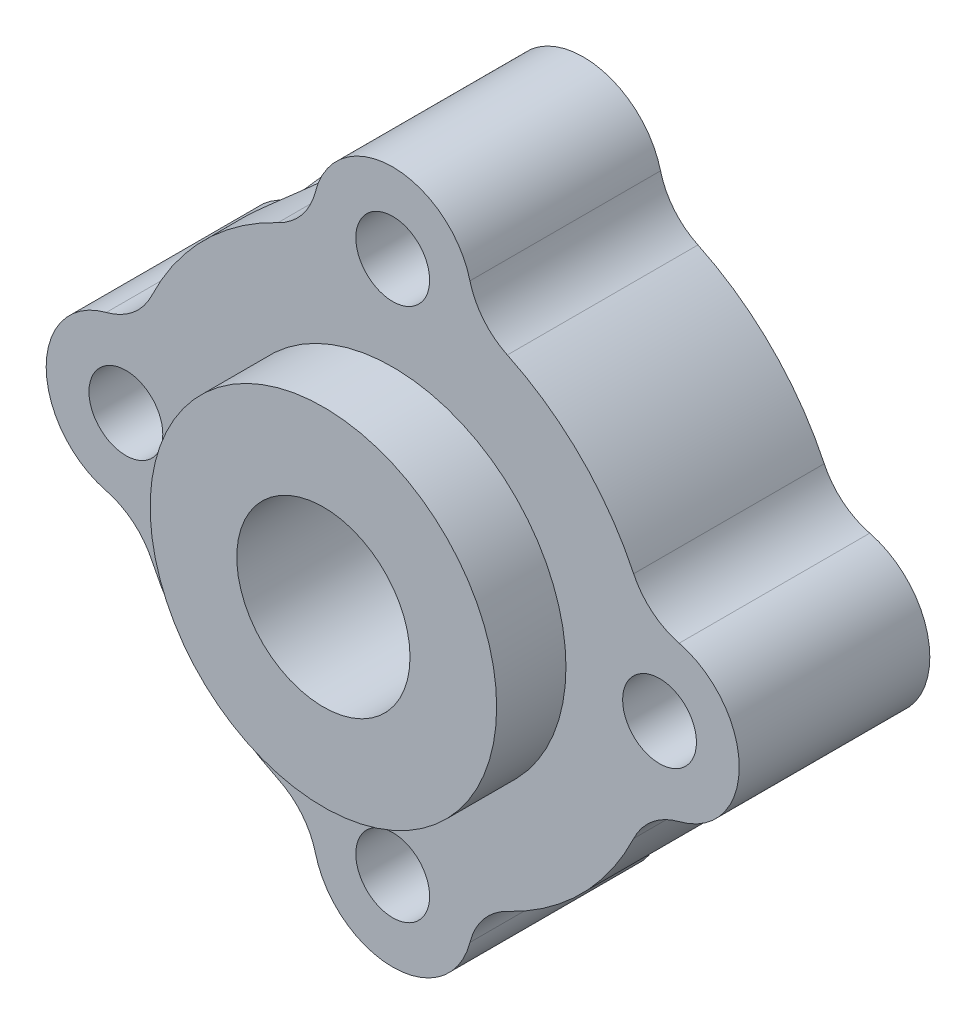
ISO-10303-21;
HEADER;
FILE_DESCRIPTION(('STEP AP214'),'2;1');
FILE_NAME('part.step','',(''),(''),'','','');
FILE_SCHEMA(('AUTOMOTIVE_DESIGN { 1 0 10303 214 1 1 1 1 }'));
ENDSEC;
DATA;
#1=APPLICATION_CONTEXT('core data for automotive mechanical design processes');
#2=APPLICATION_PROTOCOL_DEFINITION('international standard','automotive_design',2000,#1);
#3=PRODUCT_CONTEXT('',#1,'mechanical');
#4=PRODUCT('Part','Part','',(#3));
#5=PRODUCT_RELATED_PRODUCT_CATEGORY('part','',(#4));
#6=PRODUCT_DEFINITION_FORMATION('','',#4);
#7=PRODUCT_DEFINITION_CONTEXT('part definition',#1,'design');
#8=PRODUCT_DEFINITION('design','',#6,#7);
#9=PRODUCT_DEFINITION_SHAPE('','',#8);
#10=(LENGTH_UNIT() NAMED_UNIT(*) SI_UNIT(.MILLI.,.METRE.));
#11=(NAMED_UNIT(*) PLANE_ANGLE_UNIT() SI_UNIT($,.RADIAN.));
#12=(NAMED_UNIT(*) SI_UNIT($,.STERADIAN.) SOLID_ANGLE_UNIT());
#13=UNCERTAINTY_MEASURE_WITH_UNIT(LENGTH_MEASURE(1.E-05),#10,'distance_accuracy_value','');
#14=(GEOMETRIC_REPRESENTATION_CONTEXT(3) GLOBAL_UNCERTAINTY_ASSIGNED_CONTEXT((#13)) GLOBAL_UNIT_ASSIGNED_CONTEXT((#10,
#11,#12)) REPRESENTATION_CONTEXT('',''));
#15=CARTESIAN_POINT('',(0.,0.,0.));
#16=DIRECTION('',(0.,0.,1.));
#17=DIRECTION('',(1.,0.,0.));
#18=AXIS2_PLACEMENT_3D('',#15,#16,#17);
#19=CARTESIAN_POINT('',(-18.9077010991618,16.5563835829711,6.985));
#20=DIRECTION('',(0.,0.,-1.));
#21=DIRECTION('',(-1.,0.,0.));
#22=AXIS2_PLACEMENT_3D('',#19,#20,#21);
#23=CYLINDRICAL_SURFACE('',#22,9.779);
#24=CARTESIAN_POINT('',(-18.9077010991618,16.5563835829711,0.));
#25=DIRECTION('',(0.,0.,1.));
#26=DIRECTION('',(1.,0.,0.));
#27=AXIS2_PLACEMENT_3D('',#24,#25,#26);
#28=CIRCLE('',#27,9.779);
#29=CARTESIAN_POINT('',(-14.7062269233579,7.72595574791956,0.));
#30=VERTEX_POINT('',#29);
#31=CARTESIAN_POINT('',(-10.0772732641102,12.3549094071672,0.));
#32=VERTEX_POINT('',#31);
#33=EDGE_CURVE('E181',#30,#32,#28,.T.);
#34=ORIENTED_EDGE('',*,*,#33,.T.);
#35=DIRECTION('',(0.,0.,-1.));
#36=VECTOR('',#35,1.);
#37=CARTESIAN_POINT('',(-10.0772732641102,12.3549094071672,6.985));
#38=LINE('',#37,#36);
#39=CARTESIAN_POINT('',(-10.0772732641102,12.3549094071672,6.985));
#40=VERTEX_POINT('',#39);
#41=EDGE_CURVE('E158',#32,#40,#38,.F.);
#42=ORIENTED_EDGE('',*,*,#41,.T.);
#43=CARTESIAN_POINT('',(-18.9077010991618,16.5563835829711,6.985));
#44=DIRECTION('',(0.,0.,1.));
#45=DIRECTION('',(1.,0.,0.));
#46=AXIS2_PLACEMENT_3D('',#43,#44,#45);
#47=CIRCLE('',#46,9.779);
#48=CARTESIAN_POINT('',(-14.7062269233579,7.72595574791956,6.985));
#49=VERTEX_POINT('',#48);
#50=EDGE_CURVE('E203',#49,#40,#47,.T.);
#51=ORIENTED_EDGE('',*,*,#50,.F.);
#52=DIRECTION('',(0.,0.,-1.));
#53=VECTOR('',#52,1.);
#54=CARTESIAN_POINT('',(-14.7062269233579,7.72595574791956,6.985));
#55=LINE('',#54,#53);
#56=EDGE_CURVE('E174',#49,#30,#55,.T.);
#57=ORIENTED_EDGE('',*,*,#56,.T.);
#58=EDGE_LOOP('',(#34,#42,#51,#57));
#59=FACE_BOUND('',#58,.T.);
#60=ADVANCED_FACE('F34',(#59),#23,.T.);
#61=CARTESIAN_POINT('',(-9.12870109916178,16.5563835829711,6.985));
#62=DIRECTION('',(0.,0.,-1.));
#63=DIRECTION('',(-1.,0.,0.));
#64=AXIS2_PLACEMENT_3D('',#61,#62,#63);
#65=CYLINDRICAL_SURFACE('',#64,2.921);
#66=CARTESIAN_POINT('',(-9.12870109916178,16.5563835829711,6.985));
#67=DIRECTION('',(0.,0.,1.));
#68=DIRECTION('',(1.,0.,0.));
#69=AXIS2_PLACEMENT_3D('',#66,#67,#68);
#70=CIRCLE('',#69,2.921);
#71=CARTESIAN_POINT('',(-8.40925818161421,13.725369120205,6.985));
#72=VERTEX_POINT('',#71);
#73=CARTESIAN_POINT('',(-8.40925818161421,19.3873980457372,6.985));
#74=VERTEX_POINT('',#73);
#75=EDGE_CURVE('E173',#72,#74,#70,.T.);
#76=ORIENTED_EDGE('',*,*,#75,.F.);
#77=DIRECTION('',(0.,0.,-1.));
#78=VECTOR('',#77,1.);
#79=CARTESIAN_POINT('',(-8.40925818161421,13.725369120205,6.985));
#80=LINE('',#79,#78);
#81=CARTESIAN_POINT('',(-8.40925818161421,13.725369120205,0.));
#82=VERTEX_POINT('',#81);
#83=EDGE_CURVE('E157',#72,#82,#80,.T.);
#84=ORIENTED_EDGE('',*,*,#83,.T.);
#85=CARTESIAN_POINT('',(-9.12870109916178,16.5563835829711,0.));
#86=DIRECTION('',(0.,0.,1.));
#87=DIRECTION('',(1.,0.,0.));
#88=AXIS2_PLACEMENT_3D('',#85,#86,#87);
#89=CIRCLE('',#88,2.921);
#90=CARTESIAN_POINT('',(-8.40925818161421,19.3873980457372,0.));
#91=VERTEX_POINT('',#90);
#92=EDGE_CURVE('E170',#82,#91,#89,.T.);
#93=ORIENTED_EDGE('',*,*,#92,.T.);
#94=DIRECTION('',(0.,0.,-1.));
#95=VECTOR('',#94,1.);
#96=CARTESIAN_POINT('',(-8.40925818161421,19.3873980457372,6.985));
#97=LINE('',#96,#95);
#98=EDGE_CURVE('E175',#91,#74,#97,.F.);
#99=ORIENTED_EDGE('',*,*,#98,.T.);
#100=EDGE_LOOP('',(#76,#84,#93,#99));
#101=FACE_BOUND('',#100,.T.);
#102=ADVANCED_FACE('F169',(#101),#65,.T.);
#103=CARTESIAN_POINT('',(-18.9077010991618,16.5563835829711,6.985));
#104=DIRECTION('',(0.,0.,-1.));
#105=DIRECTION('',(-1.,0.,0.));
#106=AXIS2_PLACEMENT_3D('',#103,#104,#105);
#107=CYLINDRICAL_SURFACE('',#106,9.779);
#108=CARTESIAN_POINT('',(-18.9077010991618,16.5563835829711,6.985));
#109=DIRECTION('',(0.,0.,1.));
#110=DIRECTION('',(1.,0.,0.));
#111=AXIS2_PLACEMENT_3D('',#108,#109,#110);
#112=CIRCLE('',#111,9.779);
#113=CARTESIAN_POINT('',(-10.0772732641102,20.757857758775,6.985));
#114=VERTEX_POINT('',#113);
#115=CARTESIAN_POINT('',(-14.7062269233579,25.3868114180227,6.985));
#116=VERTEX_POINT('',#115);
#117=EDGE_CURVE('E522',#114,#116,#112,.T.);
#118=ORIENTED_EDGE('',*,*,#117,.F.);
#119=DIRECTION('',(0.,0.,-1.));
#120=VECTOR('',#119,1.);
#121=CARTESIAN_POINT('',(-10.0772732641102,20.757857758775,6.985));
#122=LINE('',#121,#120);
#123=CARTESIAN_POINT('',(-10.0772732641102,20.757857758775,0.));
#124=VERTEX_POINT('',#123);
#125=EDGE_CURVE('E226',#114,#124,#122,.T.);
#126=ORIENTED_EDGE('',*,*,#125,.T.);
#127=CARTESIAN_POINT('',(-18.9077010991618,16.5563835829711,0.));
#128=DIRECTION('',(0.,0.,1.));
#129=DIRECTION('',(1.,0.,0.));
#130=AXIS2_PLACEMENT_3D('',#127,#128,#129);
#131=CIRCLE('',#130,9.779);
#132=CARTESIAN_POINT('',(-14.7062269233579,25.3868114180227,0.));
#133=VERTEX_POINT('',#132);
#134=EDGE_CURVE('E180',#124,#133,#131,.T.);
#135=ORIENTED_EDGE('',*,*,#134,.T.);
#136=DIRECTION('',(0.,0.,-1.));
#137=VECTOR('',#136,1.);
#138=CARTESIAN_POINT('',(-14.7062269233579,25.3868114180227,6.985));
#139=LINE('',#138,#137);
#140=EDGE_CURVE('E224',#133,#116,#139,.F.);
#141=ORIENTED_EDGE('',*,*,#140,.T.);
#142=EDGE_LOOP('',(#118,#126,#135,#141));
#143=FACE_BOUND('',#142,.T.);
#144=ADVANCED_FACE('F324',(#143),#107,.T.);
#145=CARTESIAN_POINT('',(-18.9077010991618,26.3353835829711,6.985));
#146=DIRECTION('',(0.,0.,-1.));
#147=DIRECTION('',(-1.,0.,0.));
#148=AXIS2_PLACEMENT_3D('',#145,#146,#147);
#149=CYLINDRICAL_SURFACE('',#148,2.921);
#150=CARTESIAN_POINT('',(-18.9077010991618,26.3353835829711,6.985));
#151=DIRECTION('',(0.,0.,1.));
#152=DIRECTION('',(1.,0.,0.));
#153=AXIS2_PLACEMENT_3D('',#150,#151,#152);
#154=CIRCLE('',#153,2.921);
#155=CARTESIAN_POINT('',(-16.0766866363957,27.0548265005187,6.985));
#156=VERTEX_POINT('',#155);
#157=CARTESIAN_POINT('',(-21.7387155619278,27.0548265005187,6.985));
#158=VERTEX_POINT('',#157);
#159=EDGE_CURVE('E281',#156,#158,#154,.T.);
#160=ORIENTED_EDGE('',*,*,#159,.F.);
#161=DIRECTION('',(0.,0.,-1.));
#162=VECTOR('',#161,1.);
#163=CARTESIAN_POINT('',(-16.0766866363957,27.0548265005187,6.985));
#164=LINE('',#163,#162);
#165=CARTESIAN_POINT('',(-16.0766866363957,27.0548265005187,0.));
#166=VERTEX_POINT('',#165);
#167=EDGE_CURVE('E231',#156,#166,#164,.T.);
#168=ORIENTED_EDGE('',*,*,#167,.T.);
#169=CARTESIAN_POINT('',(-18.9077010991618,26.3353835829711,0.));
#170=DIRECTION('',(0.,0.,1.));
#171=DIRECTION('',(1.,0.,0.));
#172=AXIS2_PLACEMENT_3D('',#169,#170,#171);
#173=CIRCLE('',#172,2.921);
#174=CARTESIAN_POINT('',(-21.7387155619278,27.0548265005187,0.));
#175=VERTEX_POINT('',#174);
#176=EDGE_CURVE('E184',#166,#175,#173,.T.);
#177=ORIENTED_EDGE('',*,*,#176,.T.);
#178=DIRECTION('',(0.,0.,-1.));
#179=VECTOR('',#178,1.);
#180=CARTESIAN_POINT('',(-21.7387155619278,27.0548265005187,6.985));
#181=LINE('',#180,#179);
#182=EDGE_CURVE('E229',#175,#158,#181,.F.);
#183=ORIENTED_EDGE('',*,*,#182,.T.);
#184=EDGE_LOOP('',(#160,#168,#177,#183));
#185=FACE_BOUND('',#184,.T.);
#186=ADVANCED_FACE('F473',(#185),#149,.T.);
#187=CARTESIAN_POINT('',(-18.9077010991618,16.5563835829711,6.985));
#188=DIRECTION('',(0.,0.,-1.));
#189=DIRECTION('',(-1.,0.,0.));
#190=AXIS2_PLACEMENT_3D('',#187,#188,#189);
#191=CYLINDRICAL_SURFACE('',#190,9.779);
#192=CARTESIAN_POINT('',(-27.1894191464049,21.7565746550346,3.45963024018075));
#193=CARTESIAN_POINT('',(-27.1894179582579,21.7565792852701,3.34013326935154));
#194=CARTESIAN_POINT('',(-27.1839902900434,21.7652514572821,3.22058759832726));
#195=CARTESIAN_POINT('',(-27.1623146896423,21.7995306919697,2.98490332557513));
#196=CARTESIAN_POINT('',(-27.1460590063942,21.8251498858091,2.86876722675742));
#197=CARTESIAN_POINT('',(-27.1028783978451,21.8920637373469,2.64335074011366));
#198=CARTESIAN_POINT('',(-27.0759660159222,21.9333399636725,2.53406246665058));
#199=CARTESIAN_POINT('',(-27.0116855063629,22.0297389923081,2.32511204963179));
#200=CARTESIAN_POINT('',(-26.974317481734,22.0848616582048,2.22544981125498));
#201=CARTESIAN_POINT('',(-26.8887206787447,22.2077420483769,2.03671796627577));
#202=CARTESIAN_POINT('',(-26.8403202290966,22.2756962114304,1.94785409250368));
#203=CARTESIAN_POINT('',(-26.7335200510201,22.4209819186238,1.78503911235989));
#204=CARTESIAN_POINT('',(-26.6751194171561,22.4983143117012,1.71108935766226));
#205=CARTESIAN_POINT('',(-26.5482772720971,22.6605755102986,1.57929493911525));
#206=CARTESIAN_POINT('',(-26.4797170400498,22.7455887259223,1.52166804364349));
#207=CARTESIAN_POINT('',(-26.3343411770413,22.9192970515416,1.42554624089716));
#208=CARTESIAN_POINT('',(-26.2575264536517,23.007991756105,1.38704923292647));
#209=CARTESIAN_POINT('',(-26.0986186736739,23.1846134335266,1.33088513905905));
#210=CARTESIAN_POINT('',(-26.016626489058,23.2725308408621,1.31290289367159));
#211=CARTESIAN_POINT('',(-25.8484822992051,23.4461581512076,1.29731612412961));
#212=CARTESIAN_POINT('',(-25.7623308213547,23.5318683319854,1.29970902317722));
#213=CARTESIAN_POINT('',(-25.5900989670128,23.6969978987085,1.32456876460617));
#214=CARTESIAN_POINT('',(-25.5040479639141,23.7765055095324,1.34665571543923));
#215=CARTESIAN_POINT('',(-25.3331201856351,23.9290330009421,1.40969245282271));
#216=CARTESIAN_POINT('',(-25.2482434517422,24.0020526538974,1.45064290088933));
#217=CARTESIAN_POINT('',(-25.0819983825358,24.1404900716595,1.55045650621094));
#218=CARTESIAN_POINT('',(-25.0006517687899,24.2058640862908,1.60941638543776));
#219=CARTESIAN_POINT('',(-24.8447450507238,24.3274929977231,1.74350431775647));
#220=CARTESIAN_POINT('',(-24.7701858429075,24.3837466906448,1.81863450228118));
#221=CARTESIAN_POINT('',(-24.6290876969876,24.4874878006894,1.98474926773461));
#222=CARTESIAN_POINT('',(-24.5627443497515,24.5347720266519,2.07602710789872));
#223=CARTESIAN_POINT('',(-24.4425163676798,24.6186444506551,2.27088371404546));
#224=CARTESIAN_POINT('',(-24.3886321564042,24.6552322850733,2.37446289804248));
#225=CARTESIAN_POINT('',(-24.2954097225044,24.71754827827,2.59158970480777));
#226=CARTESIAN_POINT('',(-24.2561349200544,24.7432291561739,2.70517820174218));
#227=CARTESIAN_POINT('',(-24.1942858448331,24.7833049181198,2.9387128368082));
#228=CARTESIAN_POINT('',(-24.1717091356415,24.7977014486804,3.05865804469343));
#229=CARTESIAN_POINT('',(-24.1446160072168,24.814943937863,3.29910604197158));
#230=CARTESIAN_POINT('',(-24.1397706731189,24.8180002708469,3.41955672944035));
#231=CARTESIAN_POINT('',(-24.1474621553233,24.8131241774038,3.65967184419436));
#232=CARTESIAN_POINT('',(-24.1599978445587,24.8051924634933,3.77933632195558));
#233=CARTESIAN_POINT('',(-24.2016023676333,24.7785513516028,4.01309601465118));
#234=CARTESIAN_POINT('',(-24.2304835361223,24.759964259154,4.12723875259913));
#235=CARTESIAN_POINT('',(-24.3033283899119,24.7122361770632,4.3482722819261));
#236=CARTESIAN_POINT('',(-24.3472934696036,24.6830942116908,4.45516240176208));
#237=CARTESIAN_POINT('',(-24.4491800529437,24.6139689520034,4.66035663926827));
#238=CARTESIAN_POINT('',(-24.507293898885,24.5738352020665,4.75851450648498));
#239=CARTESIAN_POINT('',(-24.634795939323,24.4832573215093,4.94190843873342));
#240=CARTESIAN_POINT('',(-24.704185429412,24.432812005899,5.02714301667722));
#241=CARTESIAN_POINT('',(-24.8528843754034,24.3212021591536,5.18374527989556));
#242=CARTESIAN_POINT('',(-24.9323420160733,24.2598704576175,5.25485348388891));
#243=CARTESIAN_POINT('',(-25.0972815387606,24.1279797084335,5.37931846011128));
#244=CARTESIAN_POINT('',(-25.1827630826182,24.0574211785563,5.43267622782472));
#245=CARTESIAN_POINT('',(-25.3560515916076,23.9089697838674,5.51968205812179));
#246=CARTESIAN_POINT('',(-25.4438361690753,23.8311362178884,5.55347566820214));
#247=CARTESIAN_POINT('',(-25.6193654022034,23.6695138979195,5.60088745961024));
#248=CARTESIAN_POINT('',(-25.7071100617652,23.5857259921483,5.61450850858393));
#249=CARTESIAN_POINT('',(-25.8780227303135,23.4162416258931,5.62107805990009));
#250=CARTESIAN_POINT('',(-25.9612473999892,23.3306179875949,5.61443889591726));
#251=CARTESIAN_POINT('',(-26.1226887416933,23.1584081137783,5.58162264813069));
#252=CARTESIAN_POINT('',(-26.2009054526188,23.0718218857425,5.55544571609768));
#253=CARTESIAN_POINT('',(-26.3503728324755,22.900545582989,5.48444783142012));
#254=CARTESIAN_POINT('',(-26.4216329040343,22.8158530715919,5.43965248672234));
#255=CARTESIAN_POINT('',(-26.5559474747405,22.6510112621242,5.33275143273512));
#256=CARTESIAN_POINT('',(-26.6190010888102,22.5708624546237,5.27064385856345));
#257=CARTESIAN_POINT('',(-26.7371593272018,22.4162553221702,5.12937873362491));
#258=CARTESIAN_POINT('',(-26.7920735801415,22.3419481178005,5.04989649515024));
#259=CARTESIAN_POINT('',(-26.8917180342888,22.203648153286,4.87678933328057));
#260=CARTESIAN_POINT('',(-26.9364457611832,22.1396579002347,4.78316098295388));
#261=CARTESIAN_POINT('',(-27.0157980578267,22.0237973763313,4.58291991367117));
#262=CARTESIAN_POINT('',(-27.0502817571493,21.9720978906096,4.47615238008993));
#263=CARTESIAN_POINT('',(-27.1080248462726,21.8842645565145,4.25362673922062));
#264=CARTESIAN_POINT('',(-27.1312938840338,21.8481173314321,4.13787645968437));
#265=CARTESIAN_POINT('',(-27.1623665537818,21.7994699481012,3.92828028601224));
#266=CARTESIAN_POINT('',(-27.1725053283367,21.7834298459832,3.8355800021959));
#267=CARTESIAN_POINT('',(-27.1860319087779,21.7619806617362,3.64847330158703));
#268=CARTESIAN_POINT('',(-27.1894200853803,21.7565709958259,3.55406697877074));
#269=CARTESIAN_POINT('',(-27.1894191464049,21.7565746550346,3.45963024018075));
#270=B_SPLINE_CURVE_WITH_KNOTS('',3,(#192,#193,#194,#195,#196,#197,#198,#199,#200,#201,#202,
#203,#204,#205,#206,#207,#208,#209,#210,#211,#212,#213,#214,#215,#216,#217,#218,#219,#220,#221,
#222,#223,#224,#225,#226,#227,#228,#229,#230,#231,#232,#233,#234,#235,#236,#237,#238,#239,#240,
#241,#242,#243,#244,#245,#246,#247,#248,#249,#250,#251,#252,#253,#254,#255,#256,#257,#258,#259,
#260,#261,#262,#263,#264,#265,#266,#267,#268,#269),.UNSPECIFIED.,.T.,.F.,(4,2,2,2,2,2,2,2,2,2,2,
2,2,2,2,2,2,2,2,2,2,2,2,2,2,2,2,2,2,2,2,2,2,2,2,2,2,2,4),(0.,0.358144200533346,
0.716545048774927,1.07452529230911,1.43250200920476,1.7964836934683,2.1604983507646,
2.52916242940528,2.89778601526011,3.26066693519596,3.62350196309416,3.9794859002267,
4.33548232216343,4.69342532553154,5.05141553884375,5.41673943937334,5.78207575760016,
6.14898000621047,6.51583070921847,6.875840857973,7.23582766307398,7.59176288413942,
7.94773101753385,8.30883873728756,8.66998797836246,9.03725760724951,9.40450663535534,
9.76898719255694,10.1334159317696,10.4904776655113,10.8475366256019,11.2041060999958,
11.5607139990897,11.9246634478824,12.2887012061451,12.6575350800504,13.0260510776773,
13.3091028364861,13.5921390507817),.UNSPECIFIED.);
#271=CARTESIAN_POINT('',(-27.1894191464049,21.7565746550346,3.45963024018075));
#272=VERTEX_POINT('',#271);
#273=EDGE_CURVE('E504',#272,#272,#270,.T.);
#274=ORIENTED_EDGE('',*,*,#273,.T.);
#275=EDGE_LOOP('',(#274));
#276=FACE_BOUND('',#275,.T.);
#277=CARTESIAN_POINT('',(-18.9077010991618,16.5563835829711,6.985));
#278=DIRECTION('',(0.,0.,1.));
#279=DIRECTION('',(1.,0.,0.));
#280=AXIS2_PLACEMENT_3D('',#277,#278,#279);
#281=CIRCLE('',#280,9.779);
#282=CARTESIAN_POINT('',(-23.1091752749657,25.3868114180227,6.985));
#283=VERTEX_POINT('',#282);
#284=CARTESIAN_POINT('',(-27.7381289342133,20.757857758775,6.985));
#285=VERTEX_POINT('',#284);
#286=EDGE_CURVE('E273',#283,#285,#281,.T.);
#287=ORIENTED_EDGE('',*,*,#286,.F.);
#288=DIRECTION('',(0.,0.,-1.));
#289=VECTOR('',#288,1.);
#290=CARTESIAN_POINT('',(-23.1091752749657,25.3868114180227,6.985));
#291=LINE('',#290,#289);
#292=CARTESIAN_POINT('',(-23.1091752749657,25.3868114180227,0.));
#293=VERTEX_POINT('',#292);
#294=EDGE_CURVE('E164',#283,#293,#291,.T.);
#295=ORIENTED_EDGE('',*,*,#294,.T.);
#296=CARTESIAN_POINT('',(-18.9077010991618,16.5563835829711,0.));
#297=DIRECTION('',(0.,0.,1.));
#298=DIRECTION('',(1.,0.,0.));
#299=AXIS2_PLACEMENT_3D('',#296,#297,#298);
#300=CIRCLE('',#299,9.779);
#301=CARTESIAN_POINT('',(-27.7381289342133,20.757857758775,0.));
#302=VERTEX_POINT('',#301);
#303=EDGE_CURVE('E192',#293,#302,#300,.T.);
#304=ORIENTED_EDGE('',*,*,#303,.T.);
#305=DIRECTION('',(0.,0.,-1.));
#306=VECTOR('',#305,1.);
#307=CARTESIAN_POINT('',(-27.7381289342133,20.757857758775,6.985));
#308=LINE('',#307,#306);
#309=EDGE_CURVE('E54',#302,#285,#308,.F.);
#310=ORIENTED_EDGE('',*,*,#309,.T.);
#311=EDGE_LOOP('',(#287,#295,#304,#310));
#312=FACE_BOUND('',#311,.T.);
#313=ADVANCED_FACE('F264',(#276,#312),#191,.T.);
#314=CARTESIAN_POINT('',(-28.6867010991618,16.5563835829711,6.985));
#315=DIRECTION('',(0.,0.,-1.));
#316=DIRECTION('',(-1.,0.,0.));
#317=AXIS2_PLACEMENT_3D('',#314,#315,#316);
#318=CYLINDRICAL_SURFACE('',#317,2.921);
#319=CARTESIAN_POINT('',(-28.6867010991618,16.5563835829711,0.));
#320=DIRECTION('',(0.,0.,1.));
#321=DIRECTION('',(1.,0.,0.));
#322=AXIS2_PLACEMENT_3D('',#319,#320,#321);
#323=CIRCLE('',#322,2.921);
#324=CARTESIAN_POINT('',(-29.4061440167093,19.3873980457372,0.));
#325=VERTEX_POINT('',#324);
#326=CARTESIAN_POINT('',(-29.4061440167093,13.725369120205,0.));
#327=VERTEX_POINT('',#326);
#328=EDGE_CURVE('E194',#325,#327,#323,.T.);
#329=ORIENTED_EDGE('',*,*,#328,.T.);
#330=DIRECTION('',(0.,0.,-1.));
#331=VECTOR('',#330,1.);
#332=CARTESIAN_POINT('',(-29.4061440167093,13.725369120205,6.985));
#333=LINE('',#332,#331);
#334=CARTESIAN_POINT('',(-29.4061440167093,13.725369120205,6.985));
#335=VERTEX_POINT('',#334);
#336=EDGE_CURVE('E222',#327,#335,#333,.F.);
#337=ORIENTED_EDGE('',*,*,#336,.T.);
#338=CARTESIAN_POINT('',(-28.6867010991618,16.5563835829711,6.985));
#339=DIRECTION('',(0.,0.,1.));
#340=DIRECTION('',(1.,0.,0.));
#341=AXIS2_PLACEMENT_3D('',#338,#339,#340);
#342=CIRCLE('',#341,2.921);
#343=CARTESIAN_POINT('',(-29.4061440167093,19.3873980457372,6.985));
#344=VERTEX_POINT('',#343);
#345=EDGE_CURVE('E271',#344,#335,#342,.T.);
#346=ORIENTED_EDGE('',*,*,#345,.F.);
#347=DIRECTION('',(0.,0.,-1.));
#348=VECTOR('',#347,1.);
#349=CARTESIAN_POINT('',(-29.4061440167093,19.3873980457372,6.985));
#350=LINE('',#349,#348);
#351=EDGE_CURVE('E219',#344,#325,#350,.T.);
#352=ORIENTED_EDGE('',*,*,#351,.T.);
#353=EDGE_LOOP('',(#329,#337,#346,#352));
#354=FACE_BOUND('',#353,.T.);
#355=ADVANCED_FACE('F275',(#354),#318,.T.);
#356=CARTESIAN_POINT('',(-18.9077010991618,16.5563835829711,6.985));
#357=DIRECTION('',(0.,0.,-1.));
#358=DIRECTION('',(-1.,0.,0.));
#359=AXIS2_PLACEMENT_3D('',#356,#357,#358);
#360=CYLINDRICAL_SURFACE('',#359,9.779);
#361=CARTESIAN_POINT('',(-18.9077010991618,16.5563835829711,0.));
#362=DIRECTION('',(0.,0.,1.));
#363=DIRECTION('',(1.,0.,0.));
#364=AXIS2_PLACEMENT_3D('',#361,#362,#363);
#365=CIRCLE('',#364,9.779);
#366=CARTESIAN_POINT('',(-27.7381289342133,12.3549094071672,0.));
#367=VERTEX_POINT('',#366);
#368=CARTESIAN_POINT('',(-23.1091752749657,7.72595574791956,0.));
#369=VERTEX_POINT('',#368);
#370=EDGE_CURVE('E197',#367,#369,#365,.T.);
#371=ORIENTED_EDGE('',*,*,#370,.T.);
#372=DIRECTION('',(0.,0.,-1.));
#373=VECTOR('',#372,1.);
#374=CARTESIAN_POINT('',(-23.1091752749657,7.72595574791956,6.985));
#375=LINE('',#374,#373);
#376=CARTESIAN_POINT('',(-23.1091752749657,7.72595574791956,6.985));
#377=VERTEX_POINT('',#376);
#378=EDGE_CURVE('E217',#369,#377,#375,.F.);
#379=ORIENTED_EDGE('',*,*,#378,.T.);
#380=CARTESIAN_POINT('',(-18.9077010991618,16.5563835829711,6.985));
#381=DIRECTION('',(0.,0.,1.));
#382=DIRECTION('',(1.,0.,0.));
#383=AXIS2_PLACEMENT_3D('',#380,#381,#382);
#384=CIRCLE('',#383,9.779);
#385=CARTESIAN_POINT('',(-27.7381289342133,12.3549094071672,6.985));
#386=VERTEX_POINT('',#385);
#387=EDGE_CURVE('E277',#386,#377,#384,.T.);
#388=ORIENTED_EDGE('',*,*,#387,.F.);
#389=DIRECTION('',(0.,0.,-1.));
#390=VECTOR('',#389,1.);
#391=CARTESIAN_POINT('',(-27.7381289342133,12.3549094071672,6.985));
#392=LINE('',#391,#390);
#393=EDGE_CURVE('E214',#386,#367,#392,.T.);
#394=ORIENTED_EDGE('',*,*,#393,.T.);
#395=EDGE_LOOP('',(#371,#379,#388,#394));
#396=FACE_BOUND('',#395,.T.);
#397=ADVANCED_FACE('F303',(#396),#360,.T.);
#398=CARTESIAN_POINT('',(-18.9077010991618,6.77738358297111,6.985));
#399=DIRECTION('',(0.,0.,-1.));
#400=DIRECTION('',(-1.,0.,0.));
#401=AXIS2_PLACEMENT_3D('',#398,#399,#400);
#402=CYLINDRICAL_SURFACE('',#401,2.921);
#403=CARTESIAN_POINT('',(-18.9077010991618,6.77738358297111,0.));
#404=DIRECTION('',(0.,0.,1.));
#405=DIRECTION('',(1.,0.,0.));
#406=AXIS2_PLACEMENT_3D('',#403,#404,#405);
#407=CIRCLE('',#406,2.921);
#408=CARTESIAN_POINT('',(-21.7387155619278,6.05794066542354,0.));
#409=VERTEX_POINT('',#408);
#410=CARTESIAN_POINT('',(-16.0766866363957,6.05794066542354,0.));
#411=VERTEX_POINT('',#410);
#412=EDGE_CURVE('E200',#409,#411,#407,.T.);
#413=ORIENTED_EDGE('',*,*,#412,.T.);
#414=DIRECTION('',(0.,0.,-1.));
#415=VECTOR('',#414,1.);
#416=CARTESIAN_POINT('',(-16.0766866363957,6.05794066542354,6.985));
#417=LINE('',#416,#415);
#418=CARTESIAN_POINT('',(-16.0766866363957,6.05794066542354,6.985));
#419=VERTEX_POINT('',#418);
#420=EDGE_CURVE('E212',#411,#419,#417,.F.);
#421=ORIENTED_EDGE('',*,*,#420,.T.);
#422=CARTESIAN_POINT('',(-18.9077010991618,6.77738358297111,6.985));
#423=DIRECTION('',(0.,0.,1.));
#424=DIRECTION('',(1.,0.,0.));
#425=AXIS2_PLACEMENT_3D('',#422,#423,#424);
#426=CIRCLE('',#425,2.921);
#427=CARTESIAN_POINT('',(-21.7387155619278,6.05794066542354,6.985));
#428=VERTEX_POINT('',#427);
#429=EDGE_CURVE('E204',#428,#419,#426,.T.);
#430=ORIENTED_EDGE('',*,*,#429,.F.);
#431=DIRECTION('',(0.,0.,-1.));
#432=VECTOR('',#431,1.);
#433=CARTESIAN_POINT('',(-21.7387155619278,6.05794066542354,6.985));
#434=LINE('',#433,#432);
#435=EDGE_CURVE('E209',#428,#409,#434,.T.);
#436=ORIENTED_EDGE('',*,*,#435,.T.);
#437=EDGE_LOOP('',(#413,#421,#430,#436));
#438=FACE_BOUND('',#437,.T.);
#439=ADVANCED_FACE('F297',(#438),#402,.T.);
#440=CARTESIAN_POINT('',(-14.0182010991618,16.5563835829711,6.985));
#441=DIRECTION('',(0.,0.,1.));
#442=DIRECTION('',(1.,0.,0.));
#443=AXIS2_PLACEMENT_3D('',#440,#441,#442);
#444=PLANE('',#443);
#445=CARTESIAN_POINT('',(-18.9077010991618,26.3353835829711,6.985));
#446=DIRECTION('',(0.,0.,1.));
#447=DIRECTION('',(1.,0.,0.));
#448=AXIS2_PLACEMENT_3D('',#445,#446,#447);
#449=CIRCLE('',#448,1.35254999999999);
#450=CARTESIAN_POINT('',(-17.5551510991618,26.3353835829711,6.985));
#451=VERTEX_POINT('',#450);
#452=EDGE_CURVE('E563',#451,#451,#449,.T.);
#453=ORIENTED_EDGE('',*,*,#452,.F.);
#454=EDGE_LOOP('',(#453));
#455=FACE_BOUND('',#454,.T.);
#456=CARTESIAN_POINT('',(-28.6867010991618,16.5563835829711,6.985));
#457=DIRECTION('',(0.,0.,1.));
#458=DIRECTION('',(1.,0.,0.));
#459=AXIS2_PLACEMENT_3D('',#456,#457,#458);
#460=CIRCLE('',#459,1.35254999999999);
#461=CARTESIAN_POINT('',(-27.3341510991618,16.5563835829711,6.985));
#462=VERTEX_POINT('',#461);
#463=EDGE_CURVE('E558',#462,#462,#460,.T.);
#464=ORIENTED_EDGE('',*,*,#463,.F.);
#465=EDGE_LOOP('',(#464));
#466=FACE_BOUND('',#465,.T.);
#467=CARTESIAN_POINT('',(-18.9077010991618,6.7773835829711,6.985));
#468=DIRECTION('',(0.,0.,1.));
#469=DIRECTION('',(1.,0.,0.));
#470=AXIS2_PLACEMENT_3D('',#467,#468,#469);
#471=CIRCLE('',#470,1.35254999999999);
#472=CARTESIAN_POINT('',(-17.5551510991618,6.7773835829711,6.985));
#473=VERTEX_POINT('',#472);
#474=EDGE_CURVE('E552',#473,#473,#471,.T.);
#475=ORIENTED_EDGE('',*,*,#474,.F.);
#476=EDGE_LOOP('',(#475));
#477=FACE_BOUND('',#476,.T.);
#478=CARTESIAN_POINT('',(-9.12870109916177,16.5563835829711,6.985));
#479=DIRECTION('',(0.,0.,1.));
#480=DIRECTION('',(1.,0.,0.));
#481=AXIS2_PLACEMENT_3D('',#478,#479,#480);
#482=CIRCLE('',#481,1.35254999999999);
#483=CARTESIAN_POINT('',(-7.77615109916178,16.5563835829711,6.985));
#484=VERTEX_POINT('',#483);
#485=EDGE_CURVE('E544',#484,#484,#482,.T.);
#486=ORIENTED_EDGE('',*,*,#485,.F.);
#487=EDGE_LOOP('',(#486));
#488=FACE_BOUND('',#487,.T.);
#489=CARTESIAN_POINT('',(-18.9077010991618,16.5563835829711,6.985));
#490=DIRECTION('',(0.,0.,1.));
#491=DIRECTION('',(1.,0.,0.));
#492=AXIS2_PLACEMENT_3D('',#489,#490,#491);
#493=CIRCLE('',#492,6.35);
#494=CARTESIAN_POINT('',(-12.5577010991618,16.5563835829711,6.985));
#495=VERTEX_POINT('',#494);
#496=EDGE_CURVE('E535',#495,#495,#493,.T.);
#497=ORIENTED_EDGE('',*,*,#496,.F.);
#498=EDGE_LOOP('',(#497));
#499=FACE_BOUND('',#498,.T.);
#500=ORIENTED_EDGE('',*,*,#429,.T.);
#501=CARTESIAN_POINT('',(-13.6149349296426,5.43233812842565,6.985));
#502=DIRECTION('',(0.,0.,1.));
#503=DIRECTION('',(1.,0.,0.));
#504=AXIS2_PLACEMENT_3D('',#501,#502,#503);
#505=CIRCLE('',#504,2.54);
#506=EDGE_CURVE('E240',#419,#49,#505,.F.);
#507=ORIENTED_EDGE('',*,*,#506,.T.);
#508=ORIENTED_EDGE('',*,*,#50,.T.);
#509=CARTESIAN_POINT('',(-7.78365564461632,11.2636174134519,6.985));
#510=DIRECTION('',(0.,0.,1.));
#511=DIRECTION('',(1.,0.,0.));
#512=AXIS2_PLACEMENT_3D('',#509,#510,#511);
#513=CIRCLE('',#512,2.54);
#514=EDGE_CURVE('E163',#40,#72,#513,.F.);
#515=ORIENTED_EDGE('',*,*,#514,.T.);
#516=ORIENTED_EDGE('',*,*,#75,.T.);
#517=CARTESIAN_POINT('',(-7.78365564461632,21.8491497524903,6.985));
#518=DIRECTION('',(0.,0.,1.));
#519=DIRECTION('',(1.,0.,0.));
#520=AXIS2_PLACEMENT_3D('',#517,#518,#519);
#521=CIRCLE('',#520,2.54);
#522=EDGE_CURVE('E251',#74,#114,#521,.F.);
#523=ORIENTED_EDGE('',*,*,#522,.T.);
#524=ORIENTED_EDGE('',*,*,#117,.T.);
#525=CARTESIAN_POINT('',(-13.6149349296426,27.6804290375166,6.985));
#526=DIRECTION('',(0.,0.,1.));
#527=DIRECTION('',(1.,0.,0.));
#528=AXIS2_PLACEMENT_3D('',#525,#526,#527);
#529=CIRCLE('',#528,2.54);
#530=EDGE_CURVE('E255',#116,#156,#529,.F.);
#531=ORIENTED_EDGE('',*,*,#530,.T.);
#532=ORIENTED_EDGE('',*,*,#159,.T.);
#533=CARTESIAN_POINT('',(-24.2004672686809,27.6804290375166,6.985));
#534=DIRECTION('',(0.,0.,1.));
#535=DIRECTION('',(1.,0.,0.));
#536=AXIS2_PLACEMENT_3D('',#533,#534,#535);
#537=CIRCLE('',#536,2.54);
#538=EDGE_CURVE('E61',#158,#283,#537,.F.);
#539=ORIENTED_EDGE('',*,*,#538,.T.);
#540=ORIENTED_EDGE('',*,*,#286,.T.);
#541=CARTESIAN_POINT('',(-30.0317465537072,21.8491497524903,6.985));
#542=DIRECTION('',(0.,0.,1.));
#543=DIRECTION('',(1.,0.,0.));
#544=AXIS2_PLACEMENT_3D('',#541,#542,#543);
#545=CIRCLE('',#544,2.54);
#546=EDGE_CURVE('E11',#285,#344,#545,.F.);
#547=ORIENTED_EDGE('',*,*,#546,.T.);
#548=ORIENTED_EDGE('',*,*,#345,.T.);
#549=CARTESIAN_POINT('',(-30.0317465537072,11.2636174134519,6.985));
#550=DIRECTION('',(0.,0.,1.));
#551=DIRECTION('',(1.,0.,0.));
#552=AXIS2_PLACEMENT_3D('',#549,#550,#551);
#553=CIRCLE('',#552,2.54);
#554=EDGE_CURVE('E248',#335,#386,#553,.F.);
#555=ORIENTED_EDGE('',*,*,#554,.T.);
#556=ORIENTED_EDGE('',*,*,#387,.T.);
#557=CARTESIAN_POINT('',(-24.2004672686809,5.43233812842565,6.985));
#558=DIRECTION('',(0.,0.,1.));
#559=DIRECTION('',(1.,0.,0.));
#560=AXIS2_PLACEMENT_3D('',#557,#558,#559);
#561=CIRCLE('',#560,2.54);
#562=EDGE_CURVE('E244',#377,#428,#561,.F.);
#563=ORIENTED_EDGE('',*,*,#562,.T.);
#564=EDGE_LOOP('',(#500,#507,#508,#515,#516,#523,#524,#531,#532,#539,#540,#547,#548,#555,#556,#563));
#565=FACE_BOUND('',#564,.T.);
#566=ADVANCED_FACE('F270',(#455,#466,#477,#488,#499,#565),#444,.T.);
#567=CARTESIAN_POINT('',(-14.0182010991618,16.5563835829711,0.));
#568=DIRECTION('',(0.,0.,1.));
#569=DIRECTION('',(1.,0.,0.));
#570=AXIS2_PLACEMENT_3D('',#567,#568,#569);
#571=PLANE('',#570);
#572=CARTESIAN_POINT('',(-18.9077010991618,26.3353835829711,0.));
#573=DIRECTION('',(0.,0.,-1.));
#574=DIRECTION('',(-1.,0.,0.));
#575=AXIS2_PLACEMENT_3D('',#572,#573,#574);
#576=CIRCLE('',#575,1.35254999999999);
#577=CARTESIAN_POINT('',(-20.2602510991618,26.3353835829711,0.));
#578=VERTEX_POINT('',#577);
#579=EDGE_CURVE('E509',#578,#578,#576,.T.);
#580=ORIENTED_EDGE('',*,*,#579,.F.);
#581=EDGE_LOOP('',(#580));
#582=FACE_BOUND('',#581,.T.);
#583=CARTESIAN_POINT('',(-28.6867010991618,16.5563835829711,0.));
#584=DIRECTION('',(0.,0.,-1.));
#585=DIRECTION('',(-1.,0.,0.));
#586=AXIS2_PLACEMENT_3D('',#583,#584,#585);
#587=CIRCLE('',#586,1.35254999999999);
#588=CARTESIAN_POINT('',(-30.0392510991618,16.5563835829711,0.));
#589=VERTEX_POINT('',#588);
#590=EDGE_CURVE('E561',#589,#589,#587,.T.);
#591=ORIENTED_EDGE('',*,*,#590,.F.);
#592=EDGE_LOOP('',(#591));
#593=FACE_BOUND('',#592,.T.);
#594=CARTESIAN_POINT('',(-18.9077010991618,6.7773835829711,0.));
#595=DIRECTION('',(0.,0.,-1.));
#596=DIRECTION('',(-1.,0.,0.));
#597=AXIS2_PLACEMENT_3D('',#594,#595,#596);
#598=CIRCLE('',#597,1.35254999999999);
#599=CARTESIAN_POINT('',(-20.2602510991618,6.7773835829711,0.));
#600=VERTEX_POINT('',#599);
#601=EDGE_CURVE('E555',#600,#600,#598,.T.);
#602=ORIENTED_EDGE('',*,*,#601,.F.);
#603=EDGE_LOOP('',(#602));
#604=FACE_BOUND('',#603,.T.);
#605=CARTESIAN_POINT('',(-9.12870109916177,16.5563835829711,0.));
#606=DIRECTION('',(0.,0.,-1.));
#607=DIRECTION('',(-1.,0.,0.));
#608=AXIS2_PLACEMENT_3D('',#605,#606,#607);
#609=CIRCLE('',#608,1.35254999999999);
#610=CARTESIAN_POINT('',(-10.4812510991618,16.5563835829711,0.));
#611=VERTEX_POINT('',#610);
#612=EDGE_CURVE('E549',#611,#611,#609,.T.);
#613=ORIENTED_EDGE('',*,*,#612,.F.);
#614=EDGE_LOOP('',(#613));
#615=FACE_BOUND('',#614,.T.);
#616=CARTESIAN_POINT('',(-18.9077010991618,16.5563835829711,0.));
#617=DIRECTION('',(0.,0.,1.));
#618=DIRECTION('',(1.,0.,0.));
#619=AXIS2_PLACEMENT_3D('',#616,#617,#618);
#620=CIRCLE('',#619,3.175);
#621=CARTESIAN_POINT('',(-15.7327010991618,16.5563835829711,0.));
#622=VERTEX_POINT('',#621);
#623=EDGE_CURVE('E538',#622,#622,#620,.T.);
#624=ORIENTED_EDGE('',*,*,#623,.T.);
#625=EDGE_LOOP('',(#624));
#626=FACE_BOUND('',#625,.T.);
#627=ORIENTED_EDGE('',*,*,#33,.F.);
#628=CARTESIAN_POINT('',(-13.6149349296426,5.43233812842565,0.));
#629=DIRECTION('',(0.,0.,1.));
#630=DIRECTION('',(1.,0.,0.));
#631=AXIS2_PLACEMENT_3D('',#628,#629,#630);
#632=CIRCLE('',#631,2.54);
#633=EDGE_CURVE('E238',#30,#411,#632,.T.);
#634=ORIENTED_EDGE('',*,*,#633,.T.);
#635=ORIENTED_EDGE('',*,*,#412,.F.);
#636=CARTESIAN_POINT('',(-24.2004672686809,5.43233812842565,0.));
#637=DIRECTION('',(0.,0.,1.));
#638=DIRECTION('',(1.,0.,0.));
#639=AXIS2_PLACEMENT_3D('',#636,#637,#638);
#640=CIRCLE('',#639,2.54);
#641=EDGE_CURVE('E242',#409,#369,#640,.T.);
#642=ORIENTED_EDGE('',*,*,#641,.T.);
#643=ORIENTED_EDGE('',*,*,#370,.F.);
#644=CARTESIAN_POINT('',(-30.0317465537072,11.2636174134519,0.));
#645=DIRECTION('',(0.,0.,1.));
#646=DIRECTION('',(1.,0.,0.));
#647=AXIS2_PLACEMENT_3D('',#644,#645,#646);
#648=CIRCLE('',#647,2.54);
#649=EDGE_CURVE('E246',#367,#327,#648,.T.);
#650=ORIENTED_EDGE('',*,*,#649,.T.);
#651=ORIENTED_EDGE('',*,*,#328,.F.);
#652=CARTESIAN_POINT('',(-30.0317465537072,21.8491497524903,0.));
#653=DIRECTION('',(0.,0.,1.));
#654=DIRECTION('',(1.,0.,0.));
#655=AXIS2_PLACEMENT_3D('',#652,#653,#654);
#656=CIRCLE('',#655,2.54);
#657=EDGE_CURVE('E47',#325,#302,#656,.T.);
#658=ORIENTED_EDGE('',*,*,#657,.T.);
#659=ORIENTED_EDGE('',*,*,#303,.F.);
#660=CARTESIAN_POINT('',(-24.2004672686809,27.6804290375166,0.));
#661=DIRECTION('',(0.,0.,1.));
#662=DIRECTION('',(1.,0.,0.));
#663=AXIS2_PLACEMENT_3D('',#660,#661,#662);
#664=CIRCLE('',#663,2.54);
#665=EDGE_CURVE('E257',#293,#175,#664,.T.);
#666=ORIENTED_EDGE('',*,*,#665,.T.);
#667=ORIENTED_EDGE('',*,*,#176,.F.);
#668=CARTESIAN_POINT('',(-13.6149349296426,27.6804290375166,0.));
#669=DIRECTION('',(0.,0.,1.));
#670=DIRECTION('',(1.,0.,0.));
#671=AXIS2_PLACEMENT_3D('',#668,#669,#670);
#672=CIRCLE('',#671,2.54);
#673=EDGE_CURVE('E253',#166,#133,#672,.T.);
#674=ORIENTED_EDGE('',*,*,#673,.T.);
#675=ORIENTED_EDGE('',*,*,#134,.F.);
#676=CARTESIAN_POINT('',(-7.78365564461632,21.8491497524903,0.));
#677=DIRECTION('',(0.,0.,1.));
#678=DIRECTION('',(1.,0.,0.));
#679=AXIS2_PLACEMENT_3D('',#676,#677,#678);
#680=CIRCLE('',#679,2.54);
#681=EDGE_CURVE('E179',#124,#91,#680,.T.);
#682=ORIENTED_EDGE('',*,*,#681,.T.);
#683=ORIENTED_EDGE('',*,*,#92,.F.);
#684=CARTESIAN_POINT('',(-7.78365564461632,11.2636174134519,0.));
#685=DIRECTION('',(0.,0.,1.));
#686=DIRECTION('',(1.,0.,0.));
#687=AXIS2_PLACEMENT_3D('',#684,#685,#686);
#688=CIRCLE('',#687,2.54);
#689=EDGE_CURVE('E153',#82,#32,#688,.T.);
#690=ORIENTED_EDGE('',*,*,#689,.T.);
#691=EDGE_LOOP('',(#627,#634,#635,#642,#643,#650,#651,#658,#659,#666,#667,#674,#675,#682,#683,#690));
#692=FACE_BOUND('',#691,.T.);
#693=ADVANCED_FACE('F177',(#582,#593,#604,#615,#626,#692),#571,.F.);
#694=CARTESIAN_POINT('',(-7.78365564461632,11.2636174134519,6.985));
#695=DIRECTION('',(0.,0.,1.));
#696=DIRECTION('',(1.,0.,0.));
#697=AXIS2_PLACEMENT_3D('',#694,#695,#696);
#698=CYLINDRICAL_SURFACE('',#697,2.54);
#699=ORIENTED_EDGE('',*,*,#514,.F.);
#700=ORIENTED_EDGE('',*,*,#41,.F.);
#701=ORIENTED_EDGE('',*,*,#689,.F.);
#702=ORIENTED_EDGE('',*,*,#83,.F.);
#703=EDGE_LOOP('',(#699,#700,#701,#702));
#704=FACE_BOUND('',#703,.T.);
#705=ADVANCED_FACE('F156',(#704),#698,.F.);
#706=CARTESIAN_POINT('',(-13.6149349296426,5.43233812842565,6.985));
#707=DIRECTION('',(0.,0.,1.));
#708=DIRECTION('',(1.,0.,0.));
#709=AXIS2_PLACEMENT_3D('',#706,#707,#708);
#710=CYLINDRICAL_SURFACE('',#709,2.54);
#711=ORIENTED_EDGE('',*,*,#506,.F.);
#712=ORIENTED_EDGE('',*,*,#420,.F.);
#713=ORIENTED_EDGE('',*,*,#633,.F.);
#714=ORIENTED_EDGE('',*,*,#56,.F.);
#715=EDGE_LOOP('',(#711,#712,#713,#714));
#716=FACE_BOUND('',#715,.T.);
#717=ADVANCED_FACE('F294',(#716),#710,.F.);
#718=CARTESIAN_POINT('',(-24.2004672686809,5.43233812842565,6.985));
#719=DIRECTION('',(0.,0.,1.));
#720=DIRECTION('',(1.,0.,0.));
#721=AXIS2_PLACEMENT_3D('',#718,#719,#720);
#722=CYLINDRICAL_SURFACE('',#721,2.54);
#723=ORIENTED_EDGE('',*,*,#562,.F.);
#724=ORIENTED_EDGE('',*,*,#378,.F.);
#725=ORIENTED_EDGE('',*,*,#641,.F.);
#726=ORIENTED_EDGE('',*,*,#435,.F.);
#727=EDGE_LOOP('',(#723,#724,#725,#726));
#728=FACE_BOUND('',#727,.T.);
#729=ADVANCED_FACE('F299',(#728),#722,.F.);
#730=CARTESIAN_POINT('',(-30.0317465537072,11.2636174134519,6.985));
#731=DIRECTION('',(0.,0.,1.));
#732=DIRECTION('',(1.,0.,0.));
#733=AXIS2_PLACEMENT_3D('',#730,#731,#732);
#734=CYLINDRICAL_SURFACE('',#733,2.54);
#735=ORIENTED_EDGE('',*,*,#554,.F.);
#736=ORIENTED_EDGE('',*,*,#336,.F.);
#737=ORIENTED_EDGE('',*,*,#649,.F.);
#738=ORIENTED_EDGE('',*,*,#393,.F.);
#739=EDGE_LOOP('',(#735,#736,#737,#738));
#740=FACE_BOUND('',#739,.T.);
#741=ADVANCED_FACE('F307',(#740),#734,.F.);
#742=CARTESIAN_POINT('',(-7.78365564461632,21.8491497524903,6.985));
#743=DIRECTION('',(0.,0.,1.));
#744=DIRECTION('',(1.,0.,0.));
#745=AXIS2_PLACEMENT_3D('',#742,#743,#744);
#746=CYLINDRICAL_SURFACE('',#745,2.54);
#747=ORIENTED_EDGE('',*,*,#522,.F.);
#748=ORIENTED_EDGE('',*,*,#98,.F.);
#749=ORIENTED_EDGE('',*,*,#681,.F.);
#750=ORIENTED_EDGE('',*,*,#125,.F.);
#751=EDGE_LOOP('',(#747,#748,#749,#750));
#752=FACE_BOUND('',#751,.T.);
#753=ADVANCED_FACE('F309',(#752),#746,.F.);
#754=CARTESIAN_POINT('',(-13.6149349296426,27.6804290375166,6.985));
#755=DIRECTION('',(0.,0.,1.));
#756=DIRECTION('',(1.,0.,0.));
#757=AXIS2_PLACEMENT_3D('',#754,#755,#756);
#758=CYLINDRICAL_SURFACE('',#757,2.54);
#759=ORIENTED_EDGE('',*,*,#530,.F.);
#760=ORIENTED_EDGE('',*,*,#140,.F.);
#761=ORIENTED_EDGE('',*,*,#673,.F.);
#762=ORIENTED_EDGE('',*,*,#167,.F.);
#763=EDGE_LOOP('',(#759,#760,#761,#762));
#764=FACE_BOUND('',#763,.T.);
#765=ADVANCED_FACE('F315',(#764),#758,.F.);
#766=CARTESIAN_POINT('',(-24.2004672686809,27.6804290375166,6.985));
#767=DIRECTION('',(0.,0.,1.));
#768=DIRECTION('',(1.,0.,0.));
#769=AXIS2_PLACEMENT_3D('',#766,#767,#768);
#770=CYLINDRICAL_SURFACE('',#769,2.54);
#771=ORIENTED_EDGE('',*,*,#538,.F.);
#772=ORIENTED_EDGE('',*,*,#182,.F.);
#773=ORIENTED_EDGE('',*,*,#665,.F.);
#774=ORIENTED_EDGE('',*,*,#294,.F.);
#775=EDGE_LOOP('',(#771,#772,#773,#774));
#776=FACE_BOUND('',#775,.T.);
#777=ADVANCED_FACE('F359',(#776),#770,.F.);
#778=CARTESIAN_POINT('',(-30.0317465537072,21.8491497524903,6.985));
#779=DIRECTION('',(0.,0.,1.));
#780=DIRECTION('',(1.,0.,0.));
#781=AXIS2_PLACEMENT_3D('',#778,#779,#780);
#782=CYLINDRICAL_SURFACE('',#781,2.54);
#783=ORIENTED_EDGE('',*,*,#546,.F.);
#784=ORIENTED_EDGE('',*,*,#309,.F.);
#785=ORIENTED_EDGE('',*,*,#657,.F.);
#786=ORIENTED_EDGE('',*,*,#351,.F.);
#787=EDGE_LOOP('',(#783,#784,#785,#786));
#788=FACE_BOUND('',#787,.T.);
#789=ADVANCED_FACE('F36',(#788),#782,.F.);
#790=CARTESIAN_POINT('',(-18.9077010991618,16.5563835829711,9.525));
#791=DIRECTION('',(0.,0.,-1.));
#792=DIRECTION('',(-1.,0.,0.));
#793=AXIS2_PLACEMENT_3D('',#790,#791,#792);
#794=CYLINDRICAL_SURFACE('',#793,6.35);
#795=CARTESIAN_POINT('',(-18.9077010991618,16.5563835829711,9.525));
#796=DIRECTION('',(0.,0.,1.));
#797=DIRECTION('',(1.,0.,0.));
#798=AXIS2_PLACEMENT_3D('',#795,#796,#797);
#799=CIRCLE('',#798,6.35);
#800=CARTESIAN_POINT('',(-12.5577010991618,16.5563835829711,9.525));
#801=VERTEX_POINT('',#800);
#802=EDGE_CURVE('E186',#801,#801,#799,.T.);
#803=ORIENTED_EDGE('',*,*,#802,.F.);
#804=EDGE_LOOP('',(#803));
#805=FACE_BOUND('',#804,.T.);
#806=ORIENTED_EDGE('',*,*,#496,.T.);
#807=EDGE_LOOP('',(#806));
#808=FACE_BOUND('',#807,.T.);
#809=ADVANCED_FACE('F377',(#805,#808),#794,.T.);
#810=CARTESIAN_POINT('',(-18.9077010991618,16.5563835829711,9.525));
#811=DIRECTION('',(0.,0.,1.));
#812=DIRECTION('',(1.,0.,0.));
#813=AXIS2_PLACEMENT_3D('',#810,#811,#812);
#814=PLANE('',#813);
#815=CARTESIAN_POINT('',(-18.9077010991618,16.5563835829711,9.525));
#816=DIRECTION('',(0.,0.,1.));
#817=DIRECTION('',(1.,0.,0.));
#818=AXIS2_PLACEMENT_3D('',#815,#816,#817);
#819=CIRCLE('',#818,3.175);
#820=CARTESIAN_POINT('',(-15.7327010991618,16.5563835829711,9.525));
#821=VERTEX_POINT('',#820);
#822=EDGE_CURVE('E541',#821,#821,#819,.T.);
#823=ORIENTED_EDGE('',*,*,#822,.F.);
#824=EDGE_LOOP('',(#823));
#825=FACE_BOUND('',#824,.T.);
#826=ORIENTED_EDGE('',*,*,#802,.T.);
#827=EDGE_LOOP('',(#826));
#828=FACE_BOUND('',#827,.T.);
#829=ADVANCED_FACE('F385',(#825,#828),#814,.T.);
#830=CARTESIAN_POINT('',(-18.9077010991618,16.5563835829711,0.));
#831=DIRECTION('',(0.,0.,1.));
#832=DIRECTION('',(1.,0.,0.));
#833=AXIS2_PLACEMENT_3D('',#830,#831,#832);
#834=CYLINDRICAL_SURFACE('',#833,3.175);
#835=CARTESIAN_POINT('',(-22.0826877194592,16.5656010084471,3.45963024018075));
#836=CARTESIAN_POINT('',(-22.082689596638,16.56560708485,3.56241364108153));
#837=CARTESIAN_POINT('',(-22.0827096738344,16.5761891225174,3.66521200199048));
#838=CARTESIAN_POINT('',(-22.0821849532168,16.6168634766877,3.86694469215388));
#839=CARTESIAN_POINT('',(-22.0816389178683,16.6469984824157,3.96587006338438));
#840=CARTESIAN_POINT('',(-22.0785660720955,16.722630789382,4.15615446687741));
#841=CARTESIAN_POINT('',(-22.0760617729279,16.7679501756162,4.24758652409759));
#842=CARTESIAN_POINT('',(-22.0675479297471,16.8704497345959,4.42324434612117));
#843=CARTESIAN_POINT('',(-22.0615381877026,16.9276305773069,4.50746970349192));
#844=CARTESIAN_POINT('',(-22.0430244328852,17.0621104575006,4.68285702569359));
#845=CARTESIAN_POINT('',(-22.0295499921016,17.1411784781259,4.77255924149941));
#846=CARTESIAN_POINT('',(-21.9935223086749,17.3085000333222,4.94106107895059));
#847=CARTESIAN_POINT('',(-21.9709575897219,17.3967650741429,5.01984674904289));
#848=CARTESIAN_POINT('',(-21.9095905394262,17.5966451987971,5.17891317750636));
#849=CARTESIAN_POINT('',(-21.8685501053813,17.7095515157014,5.25675146895742));
#850=CARTESIAN_POINT('',(-21.7684151335255,17.9393355319915,5.39233598838489));
#851=CARTESIAN_POINT('',(-21.7093545414903,18.0562054001548,5.45011956100947));
#852=CARTESIAN_POINT('',(-21.5904329167026,18.2573852177084,5.52969046893724));
#853=CARTESIAN_POINT('',(-21.5349307182404,18.3421171027322,5.5569588197511));
#854=CARTESIAN_POINT('',(-21.4141920186021,18.5079503567884,5.59722557316754));
#855=CARTESIAN_POINT('',(-21.3489636606207,18.5890546898287,5.61023583793747));
#856=CARTESIAN_POINT('',(-21.2100496057276,18.7451641343287,5.62114258234276));
#857=CARTESIAN_POINT('',(-21.1363433367274,18.8201536216393,5.61900150151069));
#858=CARTESIAN_POINT('',(-20.9829501290353,18.961555604447,5.59950728607061));
#859=CARTESIAN_POINT('',(-20.9032618774285,19.0279662083124,5.5821508030347));
#860=CARTESIAN_POINT('',(-20.7435056017976,19.1487076475999,5.53392418590074));
#861=CARTESIAN_POINT('',(-20.6635422651901,19.2033719745583,5.50353270648977));
#862=CARTESIAN_POINT('',(-20.5031707309066,19.3030225367717,5.43062028949376));
#863=CARTESIAN_POINT('',(-20.4227624543794,19.3480069963171,5.3880971297518));
#864=CARTESIAN_POINT('',(-20.2559536674477,19.4325648114355,5.28759489867935));
#865=CARTESIAN_POINT('',(-20.1697361735376,19.4711787434534,5.22851099232241));
#866=CARTESIAN_POINT('',(-20.0019955993496,19.5382155064398,5.09892971587339));
#867=CARTESIAN_POINT('',(-19.9204773135962,19.5666280783815,5.02842095915898));
#868=CARTESIAN_POINT('',(-19.7519465806928,19.6185473369939,4.86493448520739));
#869=CARTESIAN_POINT('',(-19.6661884110998,19.6405102621679,4.77016732129263));
#870=CARTESIAN_POINT('',(-19.508525491156,19.675060438662,4.56815039220946));
#871=CARTESIAN_POINT('',(-19.436617322711,19.6876500054722,4.46090371741474));
#872=CARTESIAN_POINT('',(-19.3238609886954,19.7044061799091,4.25683765073921));
#873=CARTESIAN_POINT('',(-19.2797021581047,19.7097237989103,4.16195188001772));
#874=CARTESIAN_POINT('',(-19.2072443951508,19.7174339263219,3.96623480582461));
#875=CARTESIAN_POINT('',(-19.1789189541556,19.719831331807,3.8654137541231));
#876=CARTESIAN_POINT('',(-19.1409291949136,19.7228674834358,3.65937761996489));
#877=CARTESIAN_POINT('',(-19.1314112873542,19.7234924479189,3.55413452663425));
#878=CARTESIAN_POINT('',(-19.1327771851395,19.7233958788506,3.34378260199832));
#879=CARTESIAN_POINT('',(-19.143659796871,19.7226744240769,3.23867376319798));
#880=CARTESIAN_POINT('',(-19.182059897783,19.7195546940058,3.04389038883953));
#881=CARTESIAN_POINT('',(-19.2075829536262,19.7173527727799,2.95380349949153));
#882=CARTESIAN_POINT('',(-19.2713593524729,19.7106510901891,2.77834403704152));
#883=CARTESIAN_POINT('',(-19.3096241314127,19.7061492626689,2.69297577954517));
#884=CARTESIAN_POINT('',(-19.4138709696532,19.6913742360205,2.49502992088997));
#885=CARTESIAN_POINT('',(-19.4848206375269,19.6795151135829,2.38518352788129));
#886=CARTESIAN_POINT('',(-19.6414726051826,19.6464689891442,2.1780368505695));
#887=CARTESIAN_POINT('',(-19.7271994164924,19.6252663962636,2.08075788912167));
#888=CARTESIAN_POINT('',(-19.9099115121914,19.5705820931232,1.89921555070398));
#889=CARTESIAN_POINT('',(-20.00700364652,19.5369761792641,1.81509652677025));
#890=CARTESIAN_POINT('',(-20.2075309270391,19.4551331240562,1.66324112137372));
#891=CARTESIAN_POINT('',(-20.3109555100599,19.4069198458458,1.59547834171555));
#892=CARTESIAN_POINT('',(-20.5005170708997,19.304644850643,1.4897328368723));
#893=CARTESIAN_POINT('',(-20.5863348672337,19.2532899173404,1.44856509495497));
#894=CARTESIAN_POINT('',(-20.7564257744061,19.1396517199593,1.3805719315878));
#895=CARTESIAN_POINT('',(-20.840699871947,19.0773757262359,1.35373701629018));
#896=CARTESIAN_POINT('',(-21.0049838689805,18.9424609117607,1.31565424658393));
#897=CARTESIAN_POINT('',(-21.0849751459324,18.8697812023729,1.30446986481952));
#898=CARTESIAN_POINT('',(-21.2373631736481,18.7162428084302,1.29845843784003));
#899=CARTESIAN_POINT('',(-21.3097605378125,18.6353847855191,1.30363007040977));
#900=CARTESIAN_POINT('',(-21.4402237742122,18.4739369415005,1.32894834541058));
#901=CARTESIAN_POINT('',(-21.4989253398866,18.3936932097094,1.3480668359168));
#902=CARTESIAN_POINT('',(-21.6069308451305,18.2309960251291,1.39902790808756));
#903=CARTESIAN_POINT('',(-21.6562330415782,18.1485421656973,1.43087284650001));
#904=CARTESIAN_POINT('',(-21.7482927438214,17.9782318030628,1.50842151355457));
#905=CARTESIAN_POINT('',(-21.7903959809773,17.8903810891764,1.55490677430564));
#906=CARTESIAN_POINT('',(-21.8644116692591,17.7171493894215,1.65917901075923));
#907=CARTESIAN_POINT('',(-21.8963180870401,17.6317698928127,1.71697264501899));
#908=CARTESIAN_POINT('',(-21.9556215669254,17.4515127994069,1.85315676502951));
#909=CARTESIAN_POINT('',(-21.9813456003211,17.3574681277341,1.93337745162655));
#910=CARTESIAN_POINT('',(-22.0224519157891,17.1787678265721,2.10612183309068));
#911=CARTESIAN_POINT('',(-22.037825497475,17.094120145791,2.19865580021509));
#912=CARTESIAN_POINT('',(-22.0597385575996,16.9443804842879,2.38740566572254));
#913=CARTESIAN_POINT('',(-22.0668858106054,16.8782663240519,2.48273642333946));
#914=CARTESIAN_POINT('',(-22.0766122291119,16.7614761789342,2.68265447585589));
#915=CARTESIAN_POINT('',(-22.0791989160445,16.7107748891837,2.7872262304631));
#916=CARTESIAN_POINT('',(-22.0818615238418,16.636855410198,2.98585320875458));
#917=CARTESIAN_POINT('',(-22.0822882658242,16.6104382558176,3.07869327883038));
#918=CARTESIAN_POINT('',(-22.0827001013661,16.5748232221264,3.2675651999913));
#919=CARTESIAN_POINT('',(-22.0826859654554,16.5655953307602,3.36359118950857));
#920=CARTESIAN_POINT('',(-22.0826877194592,16.5656010084471,3.45963024018075));
#921=B_SPLINE_CURVE_WITH_KNOTS('',3,(#835,#836,#837,#838,#839,#840,#841,#842,#843,#844,#845,
#846,#847,#848,#849,#850,#851,#852,#853,#854,#855,#856,#857,#858,#859,#860,#861,#862,#863,#864,
#865,#866,#867,#868,#869,#870,#871,#872,#873,#874,#875,#876,#877,#878,#879,#880,#881,#882,#883,
#884,#885,#886,#887,#888,#889,#890,#891,#892,#893,#894,#895,#896,#897,#898,#899,#900,#901,#902,
#903,#904,#905,#906,#907,#908,#909,#910,#911,#912,#913,#914,#915,#916,#917,#918,#919,#920),
.UNSPECIFIED.,.T.,.F.,(4,2,2,2,2,2,2,2,2,2,2,2,2,2,2,2,2,2,2,2,2,2,2,2,2,2,2,2,2,2,2,2,2,2,2,2,
2,2,2,2,2,2,4),(0.,0.307892628448626,0.616459738963976,0.921530941842624,1.22661938062054,
1.58635460331597,1.94654541558341,2.3736654341702,2.79998577448824,3.11334201608671,
3.42643735922815,3.74030914296849,4.05425001728747,4.35753556679504,4.66087670474895,
4.99388350508793,5.32722426281173,5.71464528427061,6.10197056977116,6.4151550589909,
6.72781362477309,7.04289669711411,7.35796133484729,7.63782438911463,7.91793930582083,
8.30979969860183,8.70231645558082,9.09887540839427,9.49478998914175,9.81788377718787,
10.1407632865433,10.4649485147816,10.7891075366558,11.0915145788703,11.3939776483176,
11.7165780538482,12.0393689865713,12.4167045878433,12.7943569753221,13.1418305064705,
13.488730435181,13.7769236897484,14.0646132922136),.UNSPECIFIED.);
#922=CARTESIAN_POINT('',(-22.0826877194592,16.5656010084471,3.45963024018075));
#923=VERTEX_POINT('',#922);
#924=EDGE_CURVE('E38',#923,#923,#921,.T.);
#925=ORIENTED_EDGE('',*,*,#924,.T.);
#926=EDGE_LOOP('',(#925));
#927=FACE_BOUND('',#926,.T.);
#928=ORIENTED_EDGE('',*,*,#623,.F.);
#929=EDGE_LOOP('',(#928));
#930=FACE_BOUND('',#929,.T.);
#931=ORIENTED_EDGE('',*,*,#822,.T.);
#932=EDGE_LOOP('',(#931));
#933=FACE_BOUND('',#932,.T.);
#934=ADVANCED_FACE('F395',(#927,#930,#933),#834,.F.);
#935=CARTESIAN_POINT('',(-9.12870109916177,16.5563835829711,0.));
#936=DIRECTION('',(0.,0.,-1.));
#937=DIRECTION('',(-1.,0.,0.));
#938=AXIS2_PLACEMENT_3D('',#935,#936,#937);
#939=CYLINDRICAL_SURFACE('',#938,1.35254999999999);
#940=ORIENTED_EDGE('',*,*,#485,.T.);
#941=EDGE_LOOP('',(#940));
#942=FACE_BOUND('',#941,.T.);
#943=ORIENTED_EDGE('',*,*,#612,.T.);
#944=EDGE_LOOP('',(#943));
#945=FACE_BOUND('',#944,.T.);
#946=ADVANCED_FACE('F423',(#942,#945),#939,.F.);
#947=CARTESIAN_POINT('',(-18.9077010991618,6.7773835829711,0.));
#948=DIRECTION('',(0.,0.,-1.));
#949=DIRECTION('',(-1.,0.,0.));
#950=AXIS2_PLACEMENT_3D('',#947,#948,#949);
#951=CYLINDRICAL_SURFACE('',#950,1.35254999999999);
#952=ORIENTED_EDGE('',*,*,#474,.T.);
#953=EDGE_LOOP('',(#952));
#954=FACE_BOUND('',#953,.T.);
#955=ORIENTED_EDGE('',*,*,#601,.T.);
#956=EDGE_LOOP('',(#955));
#957=FACE_BOUND('',#956,.T.);
#958=ADVANCED_FACE('F429',(#954,#957),#951,.F.);
#959=CARTESIAN_POINT('',(-28.6867010991618,16.5563835829711,0.));
#960=DIRECTION('',(0.,0.,-1.));
#961=DIRECTION('',(-1.,0.,0.));
#962=AXIS2_PLACEMENT_3D('',#959,#960,#961);
#963=CYLINDRICAL_SURFACE('',#962,1.35254999999999);
#964=ORIENTED_EDGE('',*,*,#463,.T.);
#965=EDGE_LOOP('',(#964));
#966=FACE_BOUND('',#965,.T.);
#967=ORIENTED_EDGE('',*,*,#590,.T.);
#968=EDGE_LOOP('',(#967));
#969=FACE_BOUND('',#968,.T.);
#970=ADVANCED_FACE('F440',(#966,#969),#963,.F.);
#971=CARTESIAN_POINT('',(-18.9077010991618,26.3353835829711,0.));
#972=DIRECTION('',(0.,0.,-1.));
#973=DIRECTION('',(-1.,0.,0.));
#974=AXIS2_PLACEMENT_3D('',#971,#972,#973);
#975=CYLINDRICAL_SURFACE('',#974,1.35254999999999);
#976=ORIENTED_EDGE('',*,*,#452,.T.);
#977=EDGE_LOOP('',(#976));
#978=FACE_BOUND('',#977,.T.);
#979=ORIENTED_EDGE('',*,*,#579,.T.);
#980=EDGE_LOOP('',(#979));
#981=FACE_BOUND('',#980,.T.);
#982=ADVANCED_FACE('F451',(#978,#981),#975,.F.);
#983=CARTESIAN_POINT('',(-18.8884121647289,16.397205771182,3.45963024018075));
#984=DIRECTION('',(-0.701298701298701,0.712867541382517,0.));
#985=DIRECTION('',(-0.712867541382517,-0.701298701298702,0.));
#986=AXIS2_PLACEMENT_3D('',#983,#984,#985);
#987=CYLINDRICAL_SURFACE('',#986,2.159);
#988=ORIENTED_EDGE('',*,*,#924,.F.);
#989=EDGE_LOOP('',(#988));
#990=FACE_BOUND('',#989,.T.);
#991=ORIENTED_EDGE('',*,*,#273,.F.);
#992=EDGE_LOOP('',(#991));
#993=FACE_BOUND('',#992,.T.);
#994=ADVANCED_FACE('F462',(#990,#993),#987,.F.);
#995=CLOSED_SHELL('',(#60,#102,#144,#186,#313,#355,#397,#439,#566,#693,#705,#717,#729,#741,#753,
#765,#777,#789,#809,#829,#934,#946,#958,#970,#982,#994));
#996=MANIFOLD_SOLID_BREP('B2',#995);
#997=ADVANCED_BREP_SHAPE_REPRESENTATION('',(#18,#996),#14);
#998=SHAPE_DEFINITION_REPRESENTATION(#9,#997);
ENDSEC;
END-ISO-10303-21;
